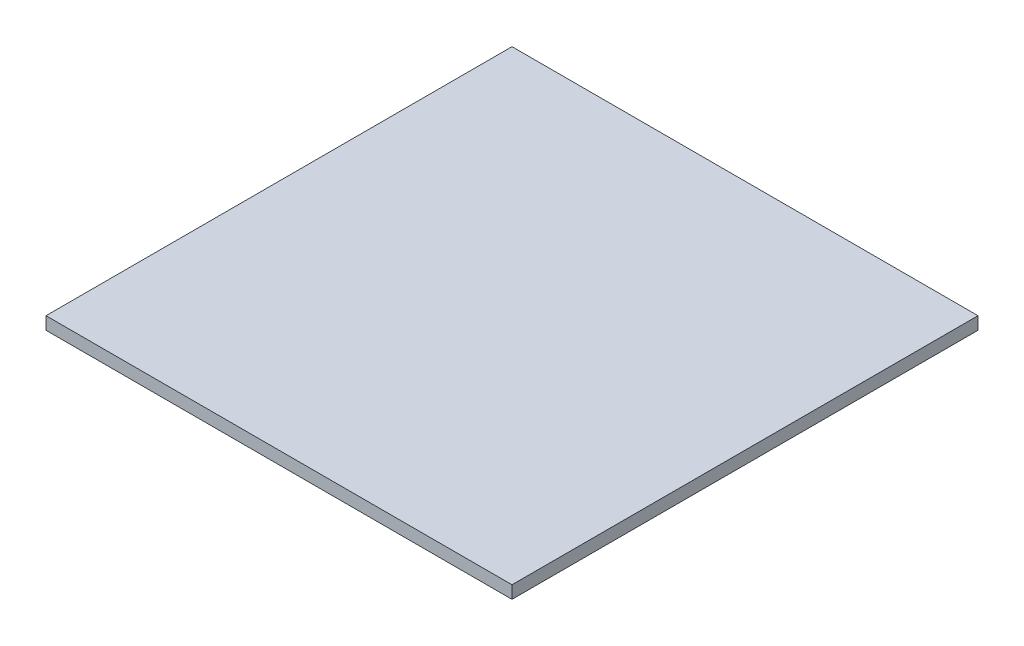
ISO-10303-21;
HEADER;
FILE_DESCRIPTION(('STEP AP214'),'2;1');
FILE_NAME('part.step','',(''),(''),'','','');
FILE_SCHEMA(('AUTOMOTIVE_DESIGN { 1 0 10303 214 1 1 1 1 }'));
ENDSEC;
DATA;
#1=APPLICATION_CONTEXT('core data for automotive mechanical design processes');
#2=APPLICATION_PROTOCOL_DEFINITION('international standard','automotive_design',2000,#1);
#3=PRODUCT_CONTEXT('',#1,'mechanical');
#4=PRODUCT('Part','Part','',(#3));
#5=PRODUCT_RELATED_PRODUCT_CATEGORY('part','',(#4));
#6=PRODUCT_DEFINITION_FORMATION('','',#4);
#7=PRODUCT_DEFINITION_CONTEXT('part definition',#1,'design');
#8=PRODUCT_DEFINITION('design','',#6,#7);
#9=PRODUCT_DEFINITION_SHAPE('','',#8);
#10=(LENGTH_UNIT() NAMED_UNIT(*) SI_UNIT(.MILLI.,.METRE.));
#11=(NAMED_UNIT(*) PLANE_ANGLE_UNIT() SI_UNIT($,.RADIAN.));
#12=(NAMED_UNIT(*) SI_UNIT($,.STERADIAN.) SOLID_ANGLE_UNIT());
#13=UNCERTAINTY_MEASURE_WITH_UNIT(LENGTH_MEASURE(1.E-05),#10,'distance_accuracy_value','');
#14=(GEOMETRIC_REPRESENTATION_CONTEXT(3) GLOBAL_UNCERTAINTY_ASSIGNED_CONTEXT((#13)) GLOBAL_UNIT_ASSIGNED_CONTEXT((#10,
#11,#12)) REPRESENTATION_CONTEXT('',''));
#15=CARTESIAN_POINT('',(0.,0.,0.));
#16=DIRECTION('',(0.,0.,1.));
#17=DIRECTION('',(1.,0.,0.));
#18=AXIS2_PLACEMENT_3D('',#15,#16,#17);
#19=CARTESIAN_POINT('',(35.,1.9,-35.));
#20=DIRECTION('',(-1.,0.,0.));
#21=DIRECTION('',(0.,0.,1.));
#22=AXIS2_PLACEMENT_3D('',#19,#20,#21);
#23=PLANE('',#22);
#24=DIRECTION('',(0.,0.,-1.));
#25=VECTOR('',#24,1.);
#26=CARTESIAN_POINT('',(35.,0.,-35.));
#27=LINE('',#26,#25);
#28=CARTESIAN_POINT('',(35.,0.,35.));
#29=VERTEX_POINT('',#28);
#30=CARTESIAN_POINT('',(35.,0.,-35.));
#31=VERTEX_POINT('',#30);
#32=EDGE_CURVE('E111',#29,#31,#27,.T.);
#33=ORIENTED_EDGE('',*,*,#32,.T.);
#34=DIRECTION('',(0.,-1.,0.));
#35=VECTOR('',#34,1.);
#36=CARTESIAN_POINT('',(35.,1.9,-35.));
#37=LINE('',#36,#35);
#38=CARTESIAN_POINT('',(35.,1.9,-35.));
#39=VERTEX_POINT('',#38);
#40=EDGE_CURVE('E11',#39,#31,#37,.T.);
#41=ORIENTED_EDGE('',*,*,#40,.F.);
#42=DIRECTION('',(0.,0.,-1.));
#43=VECTOR('',#42,1.);
#44=CARTESIAN_POINT('',(35.,1.9,-35.));
#45=LINE('',#44,#43);
#46=CARTESIAN_POINT('',(35.,1.9,35.));
#47=VERTEX_POINT('',#46);
#48=EDGE_CURVE('E95',#47,#39,#45,.T.);
#49=ORIENTED_EDGE('',*,*,#48,.F.);
#50=DIRECTION('',(0.,-1.,0.));
#51=VECTOR('',#50,1.);
#52=CARTESIAN_POINT('',(35.,1.9,35.));
#53=LINE('',#52,#51);
#54=EDGE_CURVE('E107',#47,#29,#53,.T.);
#55=ORIENTED_EDGE('',*,*,#54,.T.);
#56=EDGE_LOOP('',(#33,#41,#49,#55));
#57=FACE_BOUND('',#56,.T.);
#58=ADVANCED_FACE('F43',(#57),#23,.F.);
#59=CARTESIAN_POINT('',(-35.,1.9,-35.));
#60=DIRECTION('',(0.,0.,1.));
#61=DIRECTION('',(1.,0.,0.));
#62=AXIS2_PLACEMENT_3D('',#59,#60,#61);
#63=PLANE('',#62);
#64=DIRECTION('',(-1.,0.,0.));
#65=VECTOR('',#64,1.);
#66=CARTESIAN_POINT('',(-35.,0.,-35.));
#67=LINE('',#66,#65);
#68=CARTESIAN_POINT('',(-35.,0.,-35.));
#69=VERTEX_POINT('',#68);
#70=EDGE_CURVE('E100',#31,#69,#67,.T.);
#71=ORIENTED_EDGE('',*,*,#70,.T.);
#72=DIRECTION('',(0.,-1.,0.));
#73=VECTOR('',#72,1.);
#74=CARTESIAN_POINT('',(-35.,1.9,-35.));
#75=LINE('',#74,#73);
#76=CARTESIAN_POINT('',(-35.,1.9,-35.));
#77=VERTEX_POINT('',#76);
#78=EDGE_CURVE('E52',#77,#69,#75,.T.);
#79=ORIENTED_EDGE('',*,*,#78,.F.);
#80=DIRECTION('',(-1.,0.,0.));
#81=VECTOR('',#80,1.);
#82=CARTESIAN_POINT('',(-35.,1.9,-35.));
#83=LINE('',#82,#81);
#84=EDGE_CURVE('E90',#39,#77,#83,.T.);
#85=ORIENTED_EDGE('',*,*,#84,.F.);
#86=ORIENTED_EDGE('',*,*,#40,.T.);
#87=EDGE_LOOP('',(#71,#79,#85,#86));
#88=FACE_BOUND('',#87,.T.);
#89=ADVANCED_FACE('F99',(#88),#63,.F.);
#90=CARTESIAN_POINT('',(-35.,1.9,-35.));
#91=DIRECTION('',(1.,0.,0.));
#92=DIRECTION('',(0.,0.,-1.));
#93=AXIS2_PLACEMENT_3D('',#90,#91,#92);
#94=PLANE('',#93);
#95=DIRECTION('',(0.,0.,1.));
#96=VECTOR('',#95,1.);
#97=CARTESIAN_POINT('',(-35.,0.,-35.));
#98=LINE('',#97,#96);
#99=CARTESIAN_POINT('',(-35.,0.,35.));
#100=VERTEX_POINT('',#99);
#101=EDGE_CURVE('E77',#69,#100,#98,.T.);
#102=ORIENTED_EDGE('',*,*,#101,.T.);
#103=DIRECTION('',(0.,-1.,0.));
#104=VECTOR('',#103,1.);
#105=CARTESIAN_POINT('',(-35.,1.9,35.));
#106=LINE('',#105,#104);
#107=CARTESIAN_POINT('',(-35.,1.9,35.));
#108=VERTEX_POINT('',#107);
#109=EDGE_CURVE('E102',#108,#100,#106,.T.);
#110=ORIENTED_EDGE('',*,*,#109,.F.);
#111=DIRECTION('',(0.,0.,1.));
#112=VECTOR('',#111,1.);
#113=CARTESIAN_POINT('',(-35.,1.9,-35.));
#114=LINE('',#113,#112);
#115=EDGE_CURVE('E93',#77,#108,#114,.T.);
#116=ORIENTED_EDGE('',*,*,#115,.F.);
#117=ORIENTED_EDGE('',*,*,#78,.T.);
#118=EDGE_LOOP('',(#102,#110,#116,#117));
#119=FACE_BOUND('',#118,.T.);
#120=ADVANCED_FACE('F103',(#119),#94,.F.);
#121=CARTESIAN_POINT('',(-35.,1.9,35.));
#122=DIRECTION('',(0.,0.,-1.));
#123=DIRECTION('',(-1.,0.,0.));
#124=AXIS2_PLACEMENT_3D('',#121,#122,#123);
#125=PLANE('',#124);
#126=DIRECTION('',(1.,0.,0.));
#127=VECTOR('',#126,1.);
#128=CARTESIAN_POINT('',(-35.,0.,35.));
#129=LINE('',#128,#127);
#130=EDGE_CURVE('E83',#100,#29,#129,.T.);
#131=ORIENTED_EDGE('',*,*,#130,.T.);
#132=ORIENTED_EDGE('',*,*,#54,.F.);
#133=DIRECTION('',(1.,0.,0.));
#134=VECTOR('',#133,1.);
#135=CARTESIAN_POINT('',(-35.,1.9,35.));
#136=LINE('',#135,#134);
#137=EDGE_CURVE('E60',#108,#47,#136,.T.);
#138=ORIENTED_EDGE('',*,*,#137,.F.);
#139=ORIENTED_EDGE('',*,*,#109,.T.);
#140=EDGE_LOOP('',(#131,#132,#138,#139));
#141=FACE_BOUND('',#140,.T.);
#142=ADVANCED_FACE('F124',(#141),#125,.F.);
#143=CARTESIAN_POINT('',(0.,1.9,0.));
#144=DIRECTION('',(0.,1.,0.));
#145=DIRECTION('',(0.,0.,1.));
#146=AXIS2_PLACEMENT_3D('',#143,#144,#145);
#147=PLANE('',#146);
#148=ORIENTED_EDGE('',*,*,#48,.T.);
#149=ORIENTED_EDGE('',*,*,#84,.T.);
#150=ORIENTED_EDGE('',*,*,#115,.T.);
#151=ORIENTED_EDGE('',*,*,#137,.T.);
#152=EDGE_LOOP('',(#148,#149,#150,#151));
#153=FACE_BOUND('',#152,.T.);
#154=ADVANCED_FACE('F91',(#153),#147,.T.);
#155=CARTESIAN_POINT('',(0.,0.,0.));
#156=DIRECTION('',(0.,1.,0.));
#157=DIRECTION('',(0.,0.,1.));
#158=AXIS2_PLACEMENT_3D('',#155,#156,#157);
#159=PLANE('',#158);
#160=ORIENTED_EDGE('',*,*,#32,.F.);
#161=ORIENTED_EDGE('',*,*,#130,.F.);
#162=ORIENTED_EDGE('',*,*,#101,.F.);
#163=ORIENTED_EDGE('',*,*,#70,.F.);
#164=EDGE_LOOP('',(#160,#161,#162,#163));
#165=FACE_BOUND('',#164,.T.);
#166=ADVANCED_FACE('F127',(#165),#159,.F.);
#167=CLOSED_SHELL('',(#58,#89,#120,#142,#154,#166));
#168=MANIFOLD_SOLID_BREP('B2',#167);
#169=ADVANCED_BREP_SHAPE_REPRESENTATION('',(#18,#168),#14);
#170=SHAPE_DEFINITION_REPRESENTATION(#9,#169);
ENDSEC;
END-ISO-10303-21;
